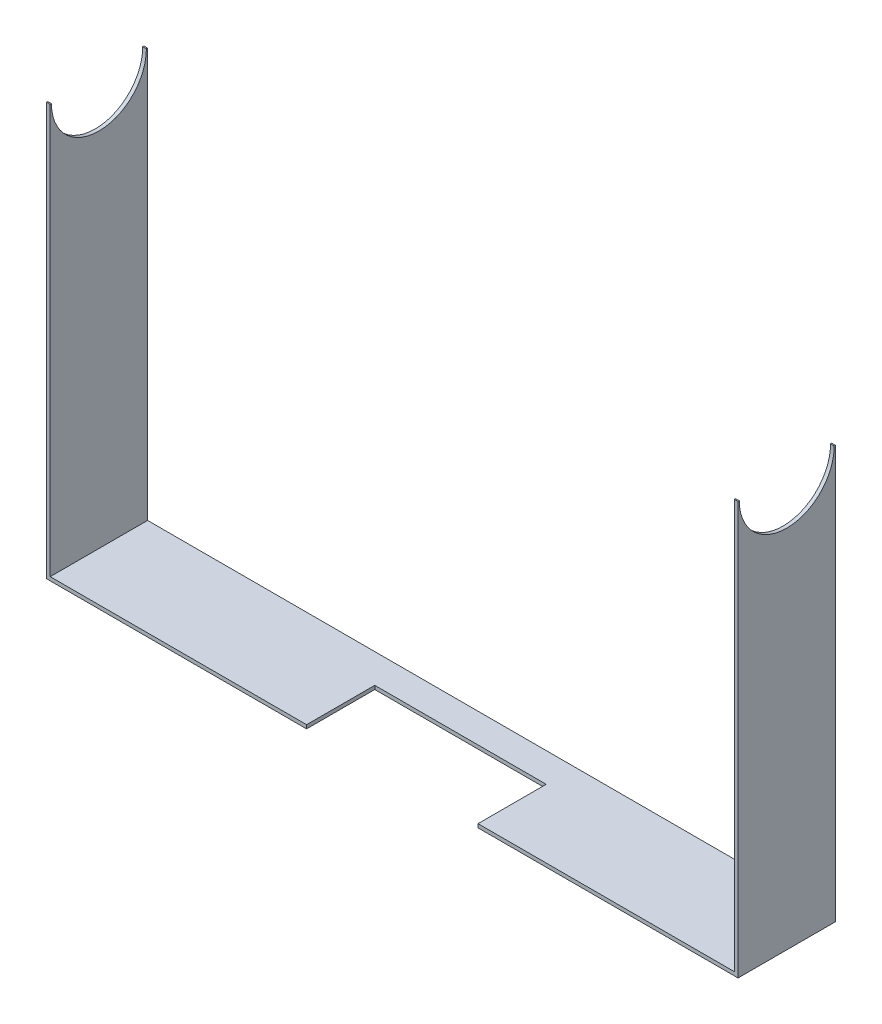
ISO-10303-21;
HEADER;
FILE_DESCRIPTION(('STEP AP214'),'2;1');
FILE_NAME('part.step','',(''),(''),'','','');
FILE_SCHEMA(('AUTOMOTIVE_DESIGN { 1 0 10303 214 1 1 1 1 }'));
ENDSEC;
DATA;
#1=APPLICATION_CONTEXT('core data for automotive mechanical design processes');
#2=APPLICATION_PROTOCOL_DEFINITION('international standard','automotive_design',2000,#1);
#3=PRODUCT_CONTEXT('',#1,'mechanical');
#4=PRODUCT('Part','Part','',(#3));
#5=PRODUCT_RELATED_PRODUCT_CATEGORY('part','',(#4));
#6=PRODUCT_DEFINITION_FORMATION('','',#4);
#7=PRODUCT_DEFINITION_CONTEXT('part definition',#1,'design');
#8=PRODUCT_DEFINITION('design','',#6,#7);
#9=PRODUCT_DEFINITION_SHAPE('','',#8);
#10=(LENGTH_UNIT() NAMED_UNIT(*) SI_UNIT(.MILLI.,.METRE.));
#11=(NAMED_UNIT(*) PLANE_ANGLE_UNIT() SI_UNIT($,.RADIAN.));
#12=(NAMED_UNIT(*) SI_UNIT($,.STERADIAN.) SOLID_ANGLE_UNIT());
#13=UNCERTAINTY_MEASURE_WITH_UNIT(LENGTH_MEASURE(1.E-05),#10,'distance_accuracy_value','');
#14=(GEOMETRIC_REPRESENTATION_CONTEXT(3) GLOBAL_UNCERTAINTY_ASSIGNED_CONTEXT((#13)) GLOBAL_UNIT_ASSIGNED_CONTEXT((#10,
#11,#12)) REPRESENTATION_CONTEXT('',''));
#15=CARTESIAN_POINT('',(0.,0.,0.));
#16=DIRECTION('',(0.,0.,1.));
#17=DIRECTION('',(1.,0.,0.));
#18=AXIS2_PLACEMENT_3D('',#15,#16,#17);
#19=CARTESIAN_POINT('',(0.,0.,40.));
#20=DIRECTION('',(0.,0.,1.));
#21=DIRECTION('',(1.,0.,0.));
#22=AXIS2_PLACEMENT_3D('',#19,#20,#21);
#23=PLANE('',#22);
#24=DIRECTION('',(0.,-1.,0.));
#25=VECTOR('',#24,1.);
#26=CARTESIAN_POINT('',(53.8127018299247,0.,40.));
#27=LINE('',#26,#25);
#28=CARTESIAN_POINT('',(53.8127018299247,-140.251388589882,40.));
#29=VERTEX_POINT('',#28);
#30=CARTESIAN_POINT('',(53.8127018299247,-141.751388589882,40.));
#31=VERTEX_POINT('',#30);
#32=EDGE_CURVE('E11',#29,#31,#27,.T.);
#33=ORIENTED_EDGE('',*,*,#32,.F.);
#34=DIRECTION('',(-1.,0.,0.));
#35=VECTOR('',#34,1.);
#36=CARTESIAN_POINT('',(229.512701829925,-140.251388589882,40.));
#37=LINE('',#36,#35);
#38=CARTESIAN_POINT('',(-51.4872981700753,-140.251388589882,40.));
#39=VERTEX_POINT('',#38);
#40=EDGE_CURVE('E172',#29,#39,#37,.T.);
#41=ORIENTED_EDGE('',*,*,#40,.T.);
#42=DIRECTION('',(0.,1.,0.));
#43=VECTOR('',#42,1.);
#44=CARTESIAN_POINT('',(-51.4872981700753,-140.251388589882,40.));
#45=LINE('',#44,#43);
#46=CARTESIAN_POINT('',(-51.4872981700753,27.7486114101184,40.));
#47=VERTEX_POINT('',#46);
#48=EDGE_CURVE('E171',#39,#47,#45,.T.);
#49=ORIENTED_EDGE('',*,*,#48,.T.);
#50=DIRECTION('',(-1.,0.,0.));
#51=VECTOR('',#50,1.);
#52=CARTESIAN_POINT('',(-51.4872981700753,27.7486114101184,40.));
#53=LINE('',#52,#51);
#54=CARTESIAN_POINT('',(-52.9872981700753,27.7486114101184,40.));
#55=VERTEX_POINT('',#54);
#56=EDGE_CURVE('E200',#47,#55,#53,.T.);
#57=ORIENTED_EDGE('',*,*,#56,.T.);
#58=DIRECTION('',(0.,-1.,0.));
#59=VECTOR('',#58,1.);
#60=CARTESIAN_POINT('',(-52.9872981700753,27.7486114101184,40.));
#61=LINE('',#60,#59);
#62=CARTESIAN_POINT('',(-52.9872981700753,-141.751388589882,40.));
#63=VERTEX_POINT('',#62);
#64=EDGE_CURVE('E273',#55,#63,#61,.T.);
#65=ORIENTED_EDGE('',*,*,#64,.T.);
#66=DIRECTION('',(1.,0.,0.));
#67=VECTOR('',#66,1.);
#68=CARTESIAN_POINT('',(-52.9872981700753,-141.751388589882,40.));
#69=LINE('',#68,#67);
#70=EDGE_CURVE('E264',#63,#31,#69,.T.);
#71=ORIENTED_EDGE('',*,*,#70,.T.);
#72=EDGE_LOOP('',(#33,#41,#49,#57,#65,#71));
#73=FACE_BOUND('',#72,.T.);
#74=ADVANCED_FACE('F38',(#73),#23,.T.);
#75=CARTESIAN_POINT('',(-51.4872981700753,27.7486114101184,40.));
#76=DIRECTION('',(0.,-1.,0.));
#77=DIRECTION('',(0.,0.,-1.));
#78=AXIS2_PLACEMENT_3D('',#75,#76,#77);
#79=PLANE('',#78);
#80=DIRECTION('',(-1.,0.,0.));
#81=VECTOR('',#80,1.);
#82=CARTESIAN_POINT('',(316.512701829925,27.7486114101184,39.5));
#83=LINE('',#82,#81);
#84=CARTESIAN_POINT('',(-52.9872981700754,27.7486114101184,39.5));
#85=VERTEX_POINT('',#84);
#86=CARTESIAN_POINT('',(-51.4872981700754,27.7486114101184,39.5));
#87=VERTEX_POINT('',#86);
#88=EDGE_CURVE('E234',#85,#87,#83,.F.);
#89=ORIENTED_EDGE('',*,*,#88,.F.);
#90=DIRECTION('',(0.,0.,-1.));
#91=VECTOR('',#90,1.);
#92=CARTESIAN_POINT('',(-52.9872981700753,27.7486114101184,40.));
#93=LINE('',#92,#91);
#94=EDGE_CURVE('E224',#55,#85,#93,.T.);
#95=ORIENTED_EDGE('',*,*,#94,.F.);
#96=ORIENTED_EDGE('',*,*,#56,.F.);
#97=DIRECTION('',(0.,0.,-1.));
#98=VECTOR('',#97,1.);
#99=CARTESIAN_POINT('',(-51.4872981700753,27.7486114101184,40.));
#100=LINE('',#99,#98);
#101=EDGE_CURVE('E201',#47,#87,#100,.T.);
#102=ORIENTED_EDGE('',*,*,#101,.T.);
#103=EDGE_LOOP('',(#89,#95,#96,#102));
#104=FACE_BOUND('',#103,.T.);
#105=ADVANCED_FACE('F40',(#104),#79,.F.);
#106=DIRECTION('',(-1.,0.,0.));
#107=VECTOR('',#106,1.);
#108=CARTESIAN_POINT('',(316.512701829925,27.7486114101184,0.5));
#109=LINE('',#108,#107);
#110=CARTESIAN_POINT('',(-51.4872981700754,27.7486114101184,0.5));
#111=VERTEX_POINT('',#110);
#112=CARTESIAN_POINT('',(-52.9872981700754,27.7486114101184,0.5));
#113=VERTEX_POINT('',#112);
#114=EDGE_CURVE('E231',#111,#113,#109,.T.);
#115=ORIENTED_EDGE('',*,*,#114,.F.);
#116=CARTESIAN_POINT('',(-51.4872981700753,27.7486114101184,0.));
#117=VERTEX_POINT('',#116);
#118=EDGE_CURVE('E174',#111,#117,#100,.T.);
#119=ORIENTED_EDGE('',*,*,#118,.T.);
#120=DIRECTION('',(-1.,0.,0.));
#121=VECTOR('',#120,1.);
#122=CARTESIAN_POINT('',(-51.4872981700753,27.7486114101184,0.));
#123=LINE('',#122,#121);
#124=CARTESIAN_POINT('',(-52.9872981700753,27.7486114101184,0.));
#125=VERTEX_POINT('',#124);
#126=EDGE_CURVE('E179',#117,#125,#123,.T.);
#127=ORIENTED_EDGE('',*,*,#126,.T.);
#128=EDGE_CURVE('E223',#113,#125,#93,.T.);
#129=ORIENTED_EDGE('',*,*,#128,.F.);
#130=EDGE_LOOP('',(#115,#119,#127,#129));
#131=FACE_BOUND('',#130,.T.);
#132=ADVANCED_FACE('F240',(#131),#79,.F.);
#133=CARTESIAN_POINT('',(231.012701829925,27.7486114101184,40.));
#134=DIRECTION('',(0.,-1.,0.));
#135=DIRECTION('',(0.,0.,-1.));
#136=AXIS2_PLACEMENT_3D('',#133,#134,#135);
#137=PLANE('',#136);
#138=DIRECTION('',(-1.,0.,0.));
#139=VECTOR('',#138,1.);
#140=CARTESIAN_POINT('',(316.512701829925,27.7486114101184,39.5));
#141=LINE('',#140,#139);
#142=CARTESIAN_POINT('',(229.512701829925,27.7486114101184,39.5));
#143=VERTEX_POINT('',#142);
#144=CARTESIAN_POINT('',(231.012701829925,27.7486114101184,39.5));
#145=VERTEX_POINT('',#144);
#146=EDGE_CURVE('E283',#143,#145,#141,.F.);
#147=ORIENTED_EDGE('',*,*,#146,.F.);
#148=DIRECTION('',(0.,0.,-1.));
#149=VECTOR('',#148,1.);
#150=CARTESIAN_POINT('',(229.512701829925,27.7486114101184,40.));
#151=LINE('',#150,#149);
#152=CARTESIAN_POINT('',(229.512701829925,27.7486114101184,40.));
#153=VERTEX_POINT('',#152);
#154=EDGE_CURVE('E210',#153,#143,#151,.T.);
#155=ORIENTED_EDGE('',*,*,#154,.F.);
#156=DIRECTION('',(-1.,0.,0.));
#157=VECTOR('',#156,1.);
#158=CARTESIAN_POINT('',(231.012701829925,27.7486114101184,40.));
#159=LINE('',#158,#157);
#160=CARTESIAN_POINT('',(231.012701829925,27.7486114101184,40.));
#161=VERTEX_POINT('',#160);
#162=EDGE_CURVE('E271',#161,#153,#159,.T.);
#163=ORIENTED_EDGE('',*,*,#162,.F.);
#164=DIRECTION('',(0.,0.,-1.));
#165=VECTOR('',#164,1.);
#166=CARTESIAN_POINT('',(231.012701829925,27.7486114101184,40.));
#167=LINE('',#166,#165);
#168=EDGE_CURVE('E214',#161,#145,#167,.T.);
#169=ORIENTED_EDGE('',*,*,#168,.T.);
#170=EDGE_LOOP('',(#147,#155,#163,#169));
#171=FACE_BOUND('',#170,.T.);
#172=ADVANCED_FACE('F282',(#171),#137,.F.);
#173=DIRECTION('',(-1.,0.,0.));
#174=VECTOR('',#173,1.);
#175=CARTESIAN_POINT('',(316.512701829925,27.7486114101184,0.5));
#176=LINE('',#175,#174);
#177=CARTESIAN_POINT('',(231.012701829925,27.7486114101184,0.5));
#178=VERTEX_POINT('',#177);
#179=CARTESIAN_POINT('',(229.512701829925,27.7486114101184,0.5));
#180=VERTEX_POINT('',#179);
#181=EDGE_CURVE('E61',#178,#180,#176,.T.);
#182=ORIENTED_EDGE('',*,*,#181,.F.);
#183=CARTESIAN_POINT('',(231.012701829925,27.7486114101184,0.));
#184=VERTEX_POINT('',#183);
#185=EDGE_CURVE('E213',#178,#184,#167,.T.);
#186=ORIENTED_EDGE('',*,*,#185,.T.);
#187=DIRECTION('',(-1.,0.,0.));
#188=VECTOR('',#187,1.);
#189=CARTESIAN_POINT('',(231.012701829925,27.7486114101184,0.));
#190=LINE('',#189,#188);
#191=CARTESIAN_POINT('',(229.512701829925,27.7486114101184,0.));
#192=VERTEX_POINT('',#191);
#193=EDGE_CURVE('E190',#184,#192,#190,.T.);
#194=ORIENTED_EDGE('',*,*,#193,.T.);
#195=EDGE_CURVE('E209',#180,#192,#151,.T.);
#196=ORIENTED_EDGE('',*,*,#195,.F.);
#197=EDGE_LOOP('',(#182,#186,#194,#196));
#198=FACE_BOUND('',#197,.T.);
#199=ADVANCED_FACE('F290',(#198),#137,.F.);
#200=CARTESIAN_POINT('',(-52.9872981700753,27.7486114101184,40.));
#201=DIRECTION('',(1.,0.,0.));
#202=DIRECTION('',(0.,1.,0.));
#203=AXIS2_PLACEMENT_3D('',#200,#201,#202);
#204=PLANE('',#203);
#205=CARTESIAN_POINT('',(-52.9872981700753,27.7486114101184,20.));
#206=DIRECTION('',(1.,0.,0.));
#207=DIRECTION('',(0.,1.,0.));
#208=AXIS2_PLACEMENT_3D('',#205,#206,#207);
#209=CIRCLE('',#208,19.5);
#210=EDGE_CURVE('E304',#113,#85,#209,.F.);
#211=ORIENTED_EDGE('',*,*,#210,.F.);
#212=ORIENTED_EDGE('',*,*,#128,.T.);
#213=DIRECTION('',(0.,-1.,0.));
#214=VECTOR('',#213,1.);
#215=CARTESIAN_POINT('',(-52.9872981700753,27.7486114101184,0.));
#216=LINE('',#215,#214);
#217=CARTESIAN_POINT('',(-52.9872981700753,-141.751388589882,0.));
#218=VERTEX_POINT('',#217);
#219=EDGE_CURVE('E182',#125,#218,#216,.T.);
#220=ORIENTED_EDGE('',*,*,#219,.T.);
#221=DIRECTION('',(0.,0.,-1.));
#222=VECTOR('',#221,1.);
#223=CARTESIAN_POINT('',(-52.9872981700753,-141.751388589882,40.));
#224=LINE('',#223,#222);
#225=EDGE_CURVE('E220',#63,#218,#224,.T.);
#226=ORIENTED_EDGE('',*,*,#225,.F.);
#227=ORIENTED_EDGE('',*,*,#64,.F.);
#228=ORIENTED_EDGE('',*,*,#94,.T.);
#229=EDGE_LOOP('',(#211,#212,#220,#226,#227,#228));
#230=FACE_BOUND('',#229,.T.);
#231=ADVANCED_FACE('F256',(#230),#204,.F.);
#232=CARTESIAN_POINT('',(-52.9872981700753,-141.751388589882,40.));
#233=DIRECTION('',(0.,1.,0.));
#234=DIRECTION('',(0.,0.,1.));
#235=AXIS2_PLACEMENT_3D('',#232,#233,#234);
#236=PLANE('',#235);
#237=DIRECTION('',(-1.,0.,0.));
#238=VECTOR('',#237,1.);
#239=CARTESIAN_POINT('',(-52.9872981700753,-141.751388589882,12.));
#240=LINE('',#239,#238);
#241=CARTESIAN_POINT('',(124.212701829925,-141.751388589882,12.));
#242=VERTEX_POINT('',#241);
#243=CARTESIAN_POINT('',(53.8127018299247,-141.751388589882,12.));
#244=VERTEX_POINT('',#243);
#245=EDGE_CURVE('E241',#242,#244,#240,.T.);
#246=ORIENTED_EDGE('',*,*,#245,.T.);
#247=DIRECTION('',(0.,0.,1.));
#248=VECTOR('',#247,1.);
#249=CARTESIAN_POINT('',(53.8127018299247,-141.751388589882,40.));
#250=LINE('',#249,#248);
#251=EDGE_CURVE('E265',#244,#31,#250,.T.);
#252=ORIENTED_EDGE('',*,*,#251,.T.);
#253=ORIENTED_EDGE('',*,*,#70,.F.);
#254=ORIENTED_EDGE('',*,*,#225,.T.);
#255=DIRECTION('',(1.,0.,0.));
#256=VECTOR('',#255,1.);
#257=CARTESIAN_POINT('',(-52.9872981700753,-141.751388589882,0.));
#258=LINE('',#257,#256);
#259=CARTESIAN_POINT('',(231.012701829925,-141.751388589882,0.));
#260=VERTEX_POINT('',#259);
#261=EDGE_CURVE('E185',#218,#260,#258,.T.);
#262=ORIENTED_EDGE('',*,*,#261,.T.);
#263=DIRECTION('',(0.,0.,-1.));
#264=VECTOR('',#263,1.);
#265=CARTESIAN_POINT('',(231.012701829925,-141.751388589882,40.));
#266=LINE('',#265,#264);
#267=CARTESIAN_POINT('',(231.012701829925,-141.751388589882,40.));
#268=VERTEX_POINT('',#267);
#269=EDGE_CURVE('E217',#268,#260,#266,.T.);
#270=ORIENTED_EDGE('',*,*,#269,.F.);
#271=CARTESIAN_POINT('',(124.212701829925,-141.751388589882,40.));
#272=VERTEX_POINT('',#271);
#273=EDGE_CURVE('E269',#272,#268,#69,.T.);
#274=ORIENTED_EDGE('',*,*,#273,.F.);
#275=DIRECTION('',(0.,0.,-1.));
#276=VECTOR('',#275,1.);
#277=CARTESIAN_POINT('',(124.212701829925,-141.751388589882,40.));
#278=LINE('',#277,#276);
#279=EDGE_CURVE('E53',#272,#242,#278,.T.);
#280=ORIENTED_EDGE('',*,*,#279,.T.);
#281=EDGE_LOOP('',(#246,#252,#253,#254,#262,#270,#274,#280));
#282=FACE_BOUND('',#281,.T.);
#283=ADVANCED_FACE('F260',(#282),#236,.F.);
#284=CARTESIAN_POINT('',(231.012701829925,-141.751388589882,40.));
#285=DIRECTION('',(-1.,0.,0.));
#286=DIRECTION('',(0.,0.,1.));
#287=AXIS2_PLACEMENT_3D('',#284,#285,#286);
#288=PLANE('',#287);
#289=CARTESIAN_POINT('',(231.012701829925,27.7486114101184,20.));
#290=DIRECTION('',(-1.,0.,0.));
#291=DIRECTION('',(0.,0.,1.));
#292=AXIS2_PLACEMENT_3D('',#289,#290,#291);
#293=CIRCLE('',#292,19.5);
#294=EDGE_CURVE('E183',#145,#178,#293,.F.);
#295=ORIENTED_EDGE('',*,*,#294,.F.);
#296=ORIENTED_EDGE('',*,*,#168,.F.);
#297=DIRECTION('',(0.,1.,0.));
#298=VECTOR('',#297,1.);
#299=CARTESIAN_POINT('',(231.012701829925,-141.751388589882,40.));
#300=LINE('',#299,#298);
#301=EDGE_CURVE('E268',#268,#161,#300,.T.);
#302=ORIENTED_EDGE('',*,*,#301,.F.);
#303=ORIENTED_EDGE('',*,*,#269,.T.);
#304=DIRECTION('',(0.,1.,0.));
#305=VECTOR('',#304,1.);
#306=CARTESIAN_POINT('',(231.012701829925,-141.751388589882,0.));
#307=LINE('',#306,#305);
#308=EDGE_CURVE('E187',#260,#184,#307,.T.);
#309=ORIENTED_EDGE('',*,*,#308,.T.);
#310=ORIENTED_EDGE('',*,*,#185,.F.);
#311=EDGE_LOOP('',(#295,#296,#302,#303,#309,#310));
#312=FACE_BOUND('',#311,.T.);
#313=ADVANCED_FACE('F294',(#312),#288,.F.);
#314=CARTESIAN_POINT('',(229.512701829925,27.7486114101184,40.));
#315=DIRECTION('',(1.,0.,0.));
#316=DIRECTION('',(0.,1.,0.));
#317=AXIS2_PLACEMENT_3D('',#314,#315,#316);
#318=PLANE('',#317);
#319=CARTESIAN_POINT('',(229.512701829925,27.7486114101184,20.));
#320=DIRECTION('',(1.,0.,0.));
#321=DIRECTION('',(0.,1.,0.));
#322=AXIS2_PLACEMENT_3D('',#319,#320,#321);
#323=CIRCLE('',#322,19.5);
#324=EDGE_CURVE('E306',#180,#143,#323,.F.);
#325=ORIENTED_EDGE('',*,*,#324,.F.);
#326=ORIENTED_EDGE('',*,*,#195,.T.);
#327=DIRECTION('',(0.,-1.,0.));
#328=VECTOR('',#327,1.);
#329=CARTESIAN_POINT('',(229.512701829925,27.7486114101184,0.));
#330=LINE('',#329,#328);
#331=CARTESIAN_POINT('',(229.512701829925,-140.251388589882,0.));
#332=VERTEX_POINT('',#331);
#333=EDGE_CURVE('E193',#192,#332,#330,.T.);
#334=ORIENTED_EDGE('',*,*,#333,.T.);
#335=DIRECTION('',(0.,0.,-1.));
#336=VECTOR('',#335,1.);
#337=CARTESIAN_POINT('',(229.512701829925,-140.251388589882,40.));
#338=LINE('',#337,#336);
#339=CARTESIAN_POINT('',(229.512701829925,-140.251388589882,40.));
#340=VERTEX_POINT('',#339);
#341=EDGE_CURVE('E207',#340,#332,#338,.T.);
#342=ORIENTED_EDGE('',*,*,#341,.F.);
#343=DIRECTION('',(0.,-1.,0.));
#344=VECTOR('',#343,1.);
#345=CARTESIAN_POINT('',(229.512701829925,27.7486114101184,40.));
#346=LINE('',#345,#344);
#347=EDGE_CURVE('E169',#153,#340,#346,.T.);
#348=ORIENTED_EDGE('',*,*,#347,.F.);
#349=ORIENTED_EDGE('',*,*,#154,.T.);
#350=EDGE_LOOP('',(#325,#326,#334,#342,#348,#349));
#351=FACE_BOUND('',#350,.T.);
#352=ADVANCED_FACE('F285',(#351),#318,.F.);
#353=CARTESIAN_POINT('',(229.512701829925,-140.251388589882,40.));
#354=DIRECTION('',(0.,-1.,0.));
#355=DIRECTION('',(1.,0.,0.));
#356=AXIS2_PLACEMENT_3D('',#353,#354,#355);
#357=PLANE('',#356);
#358=ORIENTED_EDGE('',*,*,#40,.F.);
#359=DIRECTION('',(0.,0.,1.));
#360=VECTOR('',#359,1.);
#361=CARTESIAN_POINT('',(53.8127018299247,-140.251388589882,40.));
#362=LINE('',#361,#360);
#363=CARTESIAN_POINT('',(53.8127018299247,-140.251388589882,12.));
#364=VERTEX_POINT('',#363);
#365=EDGE_CURVE('E314',#364,#29,#362,.T.);
#366=ORIENTED_EDGE('',*,*,#365,.F.);
#367=DIRECTION('',(-1.,0.,0.));
#368=VECTOR('',#367,1.);
#369=CARTESIAN_POINT('',(53.8127018299247,-140.251388589882,12.));
#370=LINE('',#369,#368);
#371=CARTESIAN_POINT('',(124.212701829925,-140.251388589882,12.));
#372=VERTEX_POINT('',#371);
#373=EDGE_CURVE('E165',#372,#364,#370,.T.);
#374=ORIENTED_EDGE('',*,*,#373,.F.);
#375=DIRECTION('',(0.,0.,-1.));
#376=VECTOR('',#375,1.);
#377=CARTESIAN_POINT('',(124.212701829925,-140.251388589882,12.));
#378=LINE('',#377,#376);
#379=CARTESIAN_POINT('',(124.212701829925,-140.251388589882,40.));
#380=VERTEX_POINT('',#379);
#381=EDGE_CURVE('E151',#380,#372,#378,.T.);
#382=ORIENTED_EDGE('',*,*,#381,.F.);
#383=EDGE_CURVE('E162',#340,#380,#37,.T.);
#384=ORIENTED_EDGE('',*,*,#383,.F.);
#385=ORIENTED_EDGE('',*,*,#341,.T.);
#386=DIRECTION('',(-1.,0.,0.));
#387=VECTOR('',#386,1.);
#388=CARTESIAN_POINT('',(229.512701829925,-140.251388589882,0.));
#389=LINE('',#388,#387);
#390=CARTESIAN_POINT('',(-51.4872981700753,-140.251388589882,0.));
#391=VERTEX_POINT('',#390);
#392=EDGE_CURVE('E195',#332,#391,#389,.T.);
#393=ORIENTED_EDGE('',*,*,#392,.T.);
#394=DIRECTION('',(0.,0.,-1.));
#395=VECTOR('',#394,1.);
#396=CARTESIAN_POINT('',(-51.4872981700753,-140.251388589882,40.));
#397=LINE('',#396,#395);
#398=EDGE_CURVE('E204',#39,#391,#397,.T.);
#399=ORIENTED_EDGE('',*,*,#398,.F.);
#400=EDGE_LOOP('',(#358,#366,#374,#382,#384,#385,#393,#399));
#401=FACE_BOUND('',#400,.T.);
#402=ADVANCED_FACE('F160',(#401),#357,.F.);
#403=CARTESIAN_POINT('',(-51.4872981700753,-140.251388589882,40.));
#404=DIRECTION('',(-1.,0.,0.));
#405=DIRECTION('',(0.,0.,1.));
#406=AXIS2_PLACEMENT_3D('',#403,#404,#405);
#407=PLANE('',#406);
#408=CARTESIAN_POINT('',(-51.4872981700754,27.7486114101184,20.));
#409=DIRECTION('',(-1.,0.,0.));
#410=DIRECTION('',(0.,0.,1.));
#411=AXIS2_PLACEMENT_3D('',#408,#409,#410);
#412=CIRCLE('',#411,19.5);
#413=EDGE_CURVE('E156',#87,#111,#412,.F.);
#414=ORIENTED_EDGE('',*,*,#413,.F.);
#415=ORIENTED_EDGE('',*,*,#101,.F.);
#416=ORIENTED_EDGE('',*,*,#48,.F.);
#417=ORIENTED_EDGE('',*,*,#398,.T.);
#418=DIRECTION('',(0.,1.,0.));
#419=VECTOR('',#418,1.);
#420=CARTESIAN_POINT('',(-51.4872981700753,-140.251388589882,0.));
#421=LINE('',#420,#419);
#422=EDGE_CURVE('E197',#391,#117,#421,.T.);
#423=ORIENTED_EDGE('',*,*,#422,.T.);
#424=ORIENTED_EDGE('',*,*,#118,.F.);
#425=EDGE_LOOP('',(#414,#415,#416,#417,#423,#424));
#426=FACE_BOUND('',#425,.T.);
#427=ADVANCED_FACE('F243',(#426),#407,.F.);
#428=DIRECTION('',(0.,1.,0.));
#429=VECTOR('',#428,1.);
#430=CARTESIAN_POINT('',(124.212701829925,0.,40.));
#431=LINE('',#430,#429);
#432=EDGE_CURVE('E46',#272,#380,#431,.T.);
#433=ORIENTED_EDGE('',*,*,#432,.F.);
#434=ORIENTED_EDGE('',*,*,#273,.T.);
#435=ORIENTED_EDGE('',*,*,#301,.T.);
#436=ORIENTED_EDGE('',*,*,#162,.T.);
#437=ORIENTED_EDGE('',*,*,#347,.T.);
#438=ORIENTED_EDGE('',*,*,#383,.T.);
#439=EDGE_LOOP('',(#433,#434,#435,#436,#437,#438));
#440=FACE_BOUND('',#439,.T.);
#441=ADVANCED_FACE('F167',(#440),#23,.T.);
#442=CARTESIAN_POINT('',(0.,0.,0.));
#443=DIRECTION('',(0.,0.,1.));
#444=DIRECTION('',(1.,0.,0.));
#445=AXIS2_PLACEMENT_3D('',#442,#443,#444);
#446=PLANE('',#445);
#447=ORIENTED_EDGE('',*,*,#126,.F.);
#448=ORIENTED_EDGE('',*,*,#422,.F.);
#449=ORIENTED_EDGE('',*,*,#392,.F.);
#450=ORIENTED_EDGE('',*,*,#333,.F.);
#451=ORIENTED_EDGE('',*,*,#193,.F.);
#452=ORIENTED_EDGE('',*,*,#308,.F.);
#453=ORIENTED_EDGE('',*,*,#261,.F.);
#454=ORIENTED_EDGE('',*,*,#219,.F.);
#455=EDGE_LOOP('',(#447,#448,#449,#450,#451,#452,#453,#454));
#456=FACE_BOUND('',#455,.T.);
#457=ADVANCED_FACE('F251',(#456),#446,.F.);
#458=CARTESIAN_POINT('',(316.512701829925,27.7486114101184,20.));
#459=DIRECTION('',(-1.,0.,0.));
#460=DIRECTION('',(0.,0.,1.));
#461=AXIS2_PLACEMENT_3D('',#458,#459,#460);
#462=CYLINDRICAL_SURFACE('',#461,19.5);
#463=ORIENTED_EDGE('',*,*,#210,.T.);
#464=ORIENTED_EDGE('',*,*,#88,.T.);
#465=ORIENTED_EDGE('',*,*,#413,.T.);
#466=ORIENTED_EDGE('',*,*,#114,.T.);
#467=EDGE_LOOP('',(#463,#464,#465,#466));
#468=FACE_BOUND('',#467,.T.);
#469=ADVANCED_FACE('F230',(#468),#462,.F.);
#470=ORIENTED_EDGE('',*,*,#294,.T.);
#471=ORIENTED_EDGE('',*,*,#181,.T.);
#472=ORIENTED_EDGE('',*,*,#324,.T.);
#473=ORIENTED_EDGE('',*,*,#146,.T.);
#474=EDGE_LOOP('',(#470,#471,#472,#473));
#475=FACE_BOUND('',#474,.T.);
#476=ADVANCED_FACE('F329',(#475),#462,.F.);
#477=CARTESIAN_POINT('',(53.8127018299247,-179.251388589882,12.));
#478=DIRECTION('',(0.,0.,-1.));
#479=DIRECTION('',(-1.,0.,0.));
#480=AXIS2_PLACEMENT_3D('',#477,#478,#479);
#481=PLANE('',#480);
#482=DIRECTION('',(0.,1.,0.));
#483=VECTOR('',#482,1.);
#484=CARTESIAN_POINT('',(124.212701829925,-179.251388589882,12.));
#485=LINE('',#484,#483);
#486=EDGE_CURVE('E298',#242,#372,#485,.T.);
#487=ORIENTED_EDGE('',*,*,#486,.T.);
#488=ORIENTED_EDGE('',*,*,#373,.T.);
#489=DIRECTION('',(0.,1.,0.));
#490=VECTOR('',#489,1.);
#491=CARTESIAN_POINT('',(53.8127018299247,-179.251388589882,12.));
#492=LINE('',#491,#490);
#493=EDGE_CURVE('E295',#244,#364,#492,.T.);
#494=ORIENTED_EDGE('',*,*,#493,.F.);
#495=ORIENTED_EDGE('',*,*,#245,.F.);
#496=EDGE_LOOP('',(#487,#488,#494,#495));
#497=FACE_BOUND('',#496,.T.);
#498=ADVANCED_FACE('F320',(#497),#481,.F.);
#499=CARTESIAN_POINT('',(53.8127018299247,-179.251388589882,40.));
#500=DIRECTION('',(-1.,0.,0.));
#501=DIRECTION('',(0.,0.,1.));
#502=AXIS2_PLACEMENT_3D('',#499,#500,#501);
#503=PLANE('',#502);
#504=ORIENTED_EDGE('',*,*,#493,.T.);
#505=ORIENTED_EDGE('',*,*,#365,.T.);
#506=ORIENTED_EDGE('',*,*,#32,.T.);
#507=ORIENTED_EDGE('',*,*,#251,.F.);
#508=EDGE_LOOP('',(#504,#505,#506,#507));
#509=FACE_BOUND('',#508,.T.);
#510=ADVANCED_FACE('F321',(#509),#503,.F.);
#511=CARTESIAN_POINT('',(124.212701829925,-179.251388589882,12.));
#512=DIRECTION('',(1.,0.,0.));
#513=DIRECTION('',(0.,0.,-1.));
#514=AXIS2_PLACEMENT_3D('',#511,#512,#513);
#515=PLANE('',#514);
#516=ORIENTED_EDGE('',*,*,#432,.T.);
#517=ORIENTED_EDGE('',*,*,#381,.T.);
#518=ORIENTED_EDGE('',*,*,#486,.F.);
#519=ORIENTED_EDGE('',*,*,#279,.F.);
#520=EDGE_LOOP('',(#516,#517,#518,#519));
#521=FACE_BOUND('',#520,.T.);
#522=ADVANCED_FACE('F150',(#521),#515,.F.);
#523=CLOSED_SHELL('',(#74,#105,#132,#172,#199,#231,#283,#313,#352,#402,#427,#441,#457,#469,#476,
#498,#510,#522));
#524=MANIFOLD_SOLID_BREP('B2',#523);
#525=ADVANCED_BREP_SHAPE_REPRESENTATION('',(#18,#524),#14);
#526=SHAPE_DEFINITION_REPRESENTATION(#9,#525);
ENDSEC;
END-ISO-10303-21;
